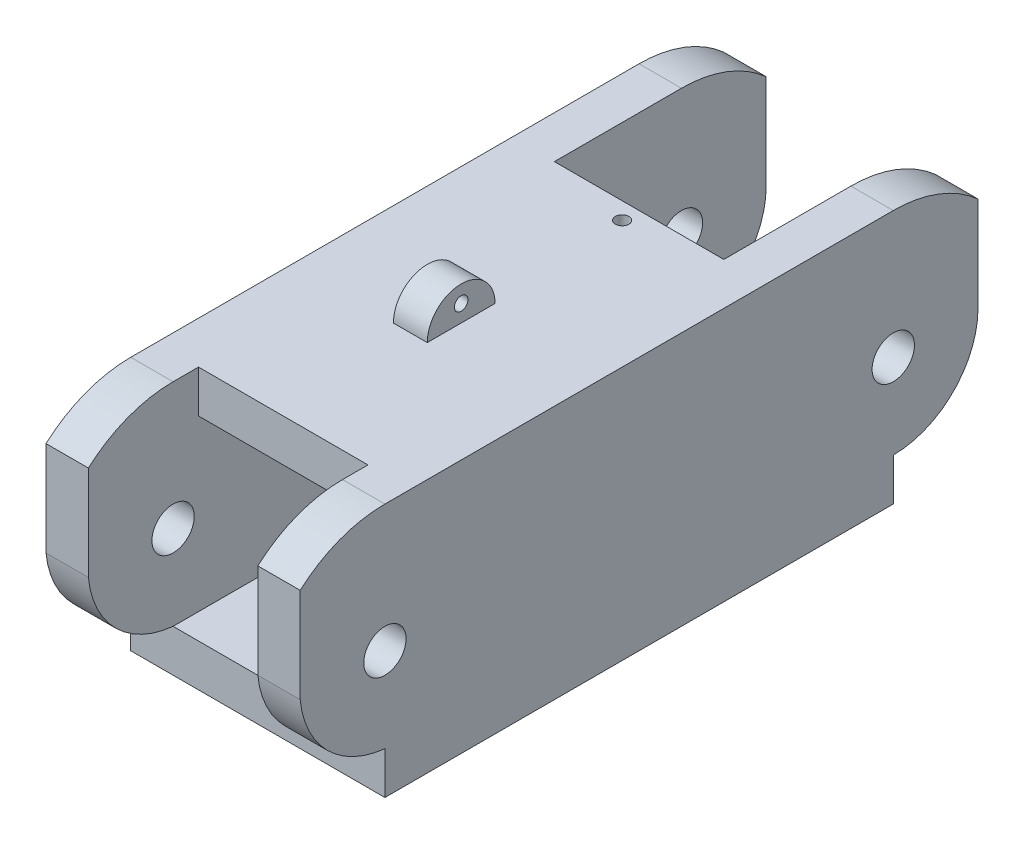
ISO-10303-21;
HEADER;
FILE_DESCRIPTION(('STEP AP214'),'2;1');
FILE_NAME('part.step','',(''),(''),'','','');
FILE_SCHEMA(('AUTOMOTIVE_DESIGN { 1 0 10303 214 1 1 1 1 }'));
ENDSEC;
DATA;
#1=APPLICATION_CONTEXT('core data for automotive mechanical design processes');
#2=APPLICATION_PROTOCOL_DEFINITION('international standard','automotive_design',2000,#1);
#3=PRODUCT_CONTEXT('',#1,'mechanical');
#4=PRODUCT('Part','Part','',(#3));
#5=PRODUCT_RELATED_PRODUCT_CATEGORY('part','',(#4));
#6=PRODUCT_DEFINITION_FORMATION('','',#4);
#7=PRODUCT_DEFINITION_CONTEXT('part definition',#1,'design');
#8=PRODUCT_DEFINITION('design','',#6,#7);
#9=PRODUCT_DEFINITION_SHAPE('','',#8);
#10=(LENGTH_UNIT() NAMED_UNIT(*) SI_UNIT(.MILLI.,.METRE.));
#11=(NAMED_UNIT(*) PLANE_ANGLE_UNIT() SI_UNIT($,.RADIAN.));
#12=(NAMED_UNIT(*) SI_UNIT($,.STERADIAN.) SOLID_ANGLE_UNIT());
#13=UNCERTAINTY_MEASURE_WITH_UNIT(LENGTH_MEASURE(1.E-05),#10,'distance_accuracy_value','');
#14=(GEOMETRIC_REPRESENTATION_CONTEXT(3) GLOBAL_UNCERTAINTY_ASSIGNED_CONTEXT((#13)) GLOBAL_UNIT_ASSIGNED_CONTEXT((#10,
#11,#12)) REPRESENTATION_CONTEXT('',''));
#15=CARTESIAN_POINT('',(0.,0.,0.));
#16=DIRECTION('',(0.,0.,1.));
#17=DIRECTION('',(1.,0.,0.));
#18=AXIS2_PLACEMENT_3D('',#15,#16,#17);
#19=CARTESIAN_POINT('',(19.05,9.525,-47.625));
#20=DIRECTION('',(-1.,0.,0.));
#21=DIRECTION('',(0.,0.,1.));
#22=AXIS2_PLACEMENT_3D('',#19,#20,#21);
#23=CYLINDRICAL_SURFACE('',#22,9.525);
#24=CARTESIAN_POINT('',(3.175,9.525,-47.625));
#25=DIRECTION('',(-1.,0.,0.));
#26=DIRECTION('',(0.,-1.,0.));
#27=AXIS2_PLACEMENT_3D('',#24,#25,#26);
#28=CIRCLE('',#27,9.525);
#29=CARTESIAN_POINT('',(3.175,19.05,-47.625));
#30=VERTEX_POINT('',#29);
#31=CARTESIAN_POINT('',(3.175,16.6245158285618,-53.975));
#32=VERTEX_POINT('',#31);
#33=EDGE_CURVE('E425',#30,#32,#28,.T.);
#34=ORIENTED_EDGE('',*,*,#33,.T.);
#35=DIRECTION('',(-1.,0.,0.));
#36=VECTOR('',#35,1.);
#37=CARTESIAN_POINT('',(19.05,16.6245158285618,-53.975));
#38=LINE('',#37,#36);
#39=CARTESIAN_POINT('',(0.,16.6245158285618,-53.975));
#40=VERTEX_POINT('',#39);
#41=EDGE_CURVE('E478',#32,#40,#38,.T.);
#42=ORIENTED_EDGE('',*,*,#41,.T.);
#43=CARTESIAN_POINT('',(0.,9.525,-47.625));
#44=DIRECTION('',(-1.,0.,0.));
#45=DIRECTION('',(0.,0.,-1.));
#46=AXIS2_PLACEMENT_3D('',#43,#44,#45);
#47=CIRCLE('',#46,9.525);
#48=CARTESIAN_POINT('',(0.,19.05,-47.625));
#49=VERTEX_POINT('',#48);
#50=EDGE_CURVE('E447',#49,#40,#47,.T.);
#51=ORIENTED_EDGE('',*,*,#50,.F.);
#52=DIRECTION('',(-1.,0.,0.));
#53=VECTOR('',#52,1.);
#54=CARTESIAN_POINT('',(19.05,19.05,-47.625));
#55=LINE('',#54,#53);
#56=EDGE_CURVE('E443',#30,#49,#55,.T.);
#57=ORIENTED_EDGE('',*,*,#56,.F.);
#58=EDGE_LOOP('',(#34,#42,#51,#57));
#59=FACE_BOUND('',#58,.T.);
#60=ADVANCED_FACE('F39',(#59),#23,.T.);
#61=CARTESIAN_POINT('',(19.05,9.525,-47.625));
#62=DIRECTION('',(-1.,0.,0.));
#63=DIRECTION('',(0.,0.,-1.));
#64=AXIS2_PLACEMENT_3D('',#61,#62,#63);
#65=CIRCLE('',#64,9.525);
#66=CARTESIAN_POINT('',(19.05,19.05,-47.625));
#67=VERTEX_POINT('',#66);
#68=CARTESIAN_POINT('',(19.05,16.6245158285618,-53.975));
#69=VERTEX_POINT('',#68);
#70=EDGE_CURVE('E446',#67,#69,#65,.T.);
#71=ORIENTED_EDGE('',*,*,#70,.T.);
#72=DIRECTION('',(-1.,0.,0.));
#73=VECTOR('',#72,1.);
#74=CARTESIAN_POINT('',(19.05,16.6245158285618,-53.975));
#75=LINE('',#74,#73);
#76=CARTESIAN_POINT('',(15.875,16.6245158285618,-53.975));
#77=VERTEX_POINT('',#76);
#78=EDGE_CURVE('E484',#69,#77,#75,.T.);
#79=ORIENTED_EDGE('',*,*,#78,.T.);
#80=CARTESIAN_POINT('',(15.875,9.525,-47.625));
#81=DIRECTION('',(1.,0.,0.));
#82=DIRECTION('',(0.,1.,0.));
#83=AXIS2_PLACEMENT_3D('',#80,#81,#82);
#84=CIRCLE('',#83,9.525);
#85=CARTESIAN_POINT('',(15.875,19.05,-47.625));
#86=VERTEX_POINT('',#85);
#87=EDGE_CURVE('E267',#77,#86,#84,.T.);
#88=ORIENTED_EDGE('',*,*,#87,.T.);
#89=EDGE_CURVE('E343',#67,#86,#55,.T.);
#90=ORIENTED_EDGE('',*,*,#89,.F.);
#91=EDGE_LOOP('',(#71,#79,#88,#90));
#92=FACE_BOUND('',#91,.T.);
#93=ADVANCED_FACE('F592',(#92),#23,.T.);
#94=CARTESIAN_POINT('',(19.05,9.525,-9.525));
#95=DIRECTION('',(-1.,0.,0.));
#96=DIRECTION('',(0.,0.,1.));
#97=AXIS2_PLACEMENT_3D('',#94,#95,#96);
#98=CYLINDRICAL_SURFACE('',#97,9.525);
#99=CARTESIAN_POINT('',(0.,9.525,-9.525));
#100=DIRECTION('',(-1.,0.,0.));
#101=DIRECTION('',(0.,0.,-1.));
#102=AXIS2_PLACEMENT_3D('',#99,#100,#101);
#103=CIRCLE('',#102,9.525);
#104=CARTESIAN_POINT('',(0.,16.6245158285618,-3.175));
#105=VERTEX_POINT('',#104);
#106=CARTESIAN_POINT('',(0.,19.05,-9.525));
#107=VERTEX_POINT('',#106);
#108=EDGE_CURVE('E284',#105,#107,#103,.T.);
#109=ORIENTED_EDGE('',*,*,#108,.F.);
#110=DIRECTION('',(-1.,0.,0.));
#111=VECTOR('',#110,1.);
#112=CARTESIAN_POINT('',(19.05,16.6245158285618,-3.17500000000001));
#113=LINE('',#112,#111);
#114=CARTESIAN_POINT('',(3.175,16.6245158285618,-3.17500000000001));
#115=VERTEX_POINT('',#114);
#116=EDGE_CURVE('E488',#105,#115,#113,.F.);
#117=ORIENTED_EDGE('',*,*,#116,.T.);
#118=CARTESIAN_POINT('',(3.175,9.525,-9.525));
#119=DIRECTION('',(-1.,0.,0.));
#120=DIRECTION('',(0.,-1.,0.));
#121=AXIS2_PLACEMENT_3D('',#118,#119,#120);
#122=CIRCLE('',#121,9.525);
#123=CARTESIAN_POINT('',(3.17500000000001,19.05,-9.525));
#124=VERTEX_POINT('',#123);
#125=EDGE_CURVE('E254',#115,#124,#122,.T.);
#126=ORIENTED_EDGE('',*,*,#125,.T.);
#127=DIRECTION('',(-1.,0.,0.));
#128=VECTOR('',#127,1.);
#129=CARTESIAN_POINT('',(19.05,19.05,-9.525));
#130=LINE('',#129,#128);
#131=EDGE_CURVE('E283',#124,#107,#130,.T.);
#132=ORIENTED_EDGE('',*,*,#131,.T.);
#133=EDGE_LOOP('',(#109,#117,#126,#132));
#134=FACE_BOUND('',#133,.T.);
#135=ADVANCED_FACE('F580',(#134),#98,.T.);
#136=CARTESIAN_POINT('',(0.,19.05,0.));
#137=DIRECTION('',(1.,0.,0.));
#138=DIRECTION('',(0.,0.,-1.));
#139=AXIS2_PLACEMENT_3D('',#136,#137,#138);
#140=PLANE('',#139);
#141=CARTESIAN_POINT('',(0.,9.525,-47.625));
#142=DIRECTION('',(1.,0.,0.));
#143=DIRECTION('',(0.,0.,-1.));
#144=AXIS2_PLACEMENT_3D('',#141,#142,#143);
#145=CIRCLE('',#144,1.5875);
#146=CARTESIAN_POINT('',(0.,9.525,-49.2125));
#147=VERTEX_POINT('',#146);
#148=EDGE_CURVE('E434',#147,#147,#145,.T.);
#149=ORIENTED_EDGE('',*,*,#148,.T.);
#150=EDGE_LOOP('',(#149));
#151=FACE_BOUND('',#150,.T.);
#152=CARTESIAN_POINT('',(0.,9.525,-9.525));
#153=DIRECTION('',(1.,0.,0.));
#154=DIRECTION('',(0.,0.,-1.));
#155=AXIS2_PLACEMENT_3D('',#152,#153,#154);
#156=CIRCLE('',#155,1.5875);
#157=CARTESIAN_POINT('',(0.,9.525,-11.1125));
#158=VERTEX_POINT('',#157);
#159=EDGE_CURVE('E259',#158,#158,#156,.T.);
#160=ORIENTED_EDGE('',*,*,#159,.T.);
#161=EDGE_LOOP('',(#160));
#162=FACE_BOUND('',#161,.T.);
#163=DIRECTION('',(0.,1.,0.));
#164=VECTOR('',#163,1.);
#165=CARTESIAN_POINT('',(0.,0.,-9.525));
#166=LINE('',#165,#164);
#167=CARTESIAN_POINT('',(0.,0.,-9.525));
#168=VERTEX_POINT('',#167);
#169=CARTESIAN_POINT('',(0.,3.175,-9.525));
#170=VERTEX_POINT('',#169);
#171=EDGE_CURVE('E208',#168,#170,#166,.T.);
#172=ORIENTED_EDGE('',*,*,#171,.T.);
#173=CARTESIAN_POINT('',(0.,10.2236491395655,-10.2236491395655));
#174=DIRECTION('',(-1.,0.,0.));
#175=DIRECTION('',(0.,0.,-1.));
#176=AXIS2_PLACEMENT_3D('',#173,#174,#175);
#177=CIRCLE('',#176,7.08318892257665);
#178=CARTESIAN_POINT('',(0.,9.525,-3.175));
#179=VERTEX_POINT('',#178);
#180=EDGE_CURVE('E544',#170,#179,#177,.T.);
#181=ORIENTED_EDGE('',*,*,#180,.T.);
#182=DIRECTION('',(0.,1.,0.));
#183=VECTOR('',#182,1.);
#184=CARTESIAN_POINT('',(0.,9.525,-3.175));
#185=LINE('',#184,#183);
#186=EDGE_CURVE('E225',#179,#105,#185,.T.);
#187=ORIENTED_EDGE('',*,*,#186,.T.);
#188=ORIENTED_EDGE('',*,*,#108,.T.);
#189=DIRECTION('',(0.,0.,1.));
#190=VECTOR('',#189,1.);
#191=CARTESIAN_POINT('',(0.,19.05,0.));
#192=LINE('',#191,#190);
#193=EDGE_CURVE('E231',#49,#107,#192,.T.);
#194=ORIENTED_EDGE('',*,*,#193,.F.);
#195=ORIENTED_EDGE('',*,*,#50,.T.);
#196=DIRECTION('',(0.,-1.,0.));
#197=VECTOR('',#196,1.);
#198=CARTESIAN_POINT('',(0.,9.52500000000001,-53.975));
#199=LINE('',#198,#197);
#200=CARTESIAN_POINT('',(0.,9.525,-53.975));
#201=VERTEX_POINT('',#200);
#202=EDGE_CURVE('E523',#40,#201,#199,.T.);
#203=ORIENTED_EDGE('',*,*,#202,.T.);
#204=CARTESIAN_POINT('',(0.,9.525,-47.625));
#205=DIRECTION('',(-1.,0.,0.));
#206=DIRECTION('',(0.,0.,-1.));
#207=AXIS2_PLACEMENT_3D('',#204,#205,#206);
#208=CIRCLE('',#207,6.35);
#209=CARTESIAN_POINT('',(0.,3.175,-47.6250000000001));
#210=VERTEX_POINT('',#209);
#211=EDGE_CURVE('E519',#201,#210,#208,.T.);
#212=ORIENTED_EDGE('',*,*,#211,.T.);
#213=DIRECTION('',(0.,-1.,0.));
#214=VECTOR('',#213,1.);
#215=CARTESIAN_POINT('',(0.,0.,-47.6250000000001));
#216=LINE('',#215,#214);
#217=CARTESIAN_POINT('',(0.,0.,-47.6250000000001));
#218=VERTEX_POINT('',#217);
#219=EDGE_CURVE('E514',#210,#218,#216,.T.);
#220=ORIENTED_EDGE('',*,*,#219,.T.);
#221=DIRECTION('',(0.,0.,1.));
#222=VECTOR('',#221,1.);
#223=CARTESIAN_POINT('',(0.,0.,0.));
#224=LINE('',#223,#222);
#225=EDGE_CURVE('E232',#218,#168,#224,.T.);
#226=ORIENTED_EDGE('',*,*,#225,.T.);
#227=EDGE_LOOP('',(#172,#181,#187,#188,#194,#195,#203,#212,#220,#226));
#228=FACE_BOUND('',#227,.T.);
#229=ADVANCED_FACE('F41',(#151,#162,#228),#140,.F.);
#230=CARTESIAN_POINT('',(19.05,19.05,0.));
#231=DIRECTION('',(-1.,0.,0.));
#232=DIRECTION('',(0.,0.,1.));
#233=AXIS2_PLACEMENT_3D('',#230,#231,#232);
#234=PLANE('',#233);
#235=CARTESIAN_POINT('',(19.05,9.525,-47.625));
#236=DIRECTION('',(1.,0.,0.));
#237=DIRECTION('',(0.,0.,-1.));
#238=AXIS2_PLACEMENT_3D('',#235,#236,#237);
#239=CIRCLE('',#238,1.5875);
#240=CARTESIAN_POINT('',(19.05,9.525,-49.2125));
#241=VERTEX_POINT('',#240);
#242=EDGE_CURVE('E266',#241,#241,#239,.T.);
#243=ORIENTED_EDGE('',*,*,#242,.F.);
#244=EDGE_LOOP('',(#243));
#245=FACE_BOUND('',#244,.T.);
#246=CARTESIAN_POINT('',(19.05,9.525,-9.525));
#247=DIRECTION('',(1.,0.,0.));
#248=DIRECTION('',(0.,0.,-1.));
#249=AXIS2_PLACEMENT_3D('',#246,#247,#248);
#250=CIRCLE('',#249,1.5875);
#251=CARTESIAN_POINT('',(19.05,9.525,-11.1125));
#252=VERTEX_POINT('',#251);
#253=EDGE_CURVE('E290',#252,#252,#250,.T.);
#254=ORIENTED_EDGE('',*,*,#253,.F.);
#255=EDGE_LOOP('',(#254));
#256=FACE_BOUND('',#255,.T.);
#257=DIRECTION('',(0.,1.,0.));
#258=VECTOR('',#257,1.);
#259=CARTESIAN_POINT('',(19.05,0.,-9.525));
#260=LINE('',#259,#258);
#261=CARTESIAN_POINT('',(19.05,0.,-9.525));
#262=VERTEX_POINT('',#261);
#263=CARTESIAN_POINT('',(19.05,3.175,-9.525));
#264=VERTEX_POINT('',#263);
#265=EDGE_CURVE('E205',#262,#264,#260,.T.);
#266=ORIENTED_EDGE('',*,*,#265,.F.);
#267=DIRECTION('',(0.,0.,-1.));
#268=VECTOR('',#267,1.);
#269=CARTESIAN_POINT('',(19.05,0.,0.));
#270=LINE('',#269,#268);
#271=CARTESIAN_POINT('',(19.05,0.,-47.6250000000001));
#272=VERTEX_POINT('',#271);
#273=EDGE_CURVE('E222',#262,#272,#270,.T.);
#274=ORIENTED_EDGE('',*,*,#273,.T.);
#275=DIRECTION('',(0.,-1.,0.));
#276=VECTOR('',#275,1.);
#277=CARTESIAN_POINT('',(19.05,0.,-47.6250000000001));
#278=LINE('',#277,#276);
#279=CARTESIAN_POINT('',(19.05,3.175,-47.6250000000001));
#280=VERTEX_POINT('',#279);
#281=EDGE_CURVE('E527',#280,#272,#278,.T.);
#282=ORIENTED_EDGE('',*,*,#281,.F.);
#283=CARTESIAN_POINT('',(19.05,9.525,-47.625));
#284=DIRECTION('',(-1.,0.,0.));
#285=DIRECTION('',(0.,0.,-1.));
#286=AXIS2_PLACEMENT_3D('',#283,#284,#285);
#287=CIRCLE('',#286,6.35);
#288=CARTESIAN_POINT('',(19.05,9.525,-53.975));
#289=VERTEX_POINT('',#288);
#290=EDGE_CURVE('E530',#289,#280,#287,.T.);
#291=ORIENTED_EDGE('',*,*,#290,.F.);
#292=DIRECTION('',(0.,-1.,0.));
#293=VECTOR('',#292,1.);
#294=CARTESIAN_POINT('',(19.05,9.52500000000001,-53.975));
#295=LINE('',#294,#293);
#296=EDGE_CURVE('E518',#69,#289,#295,.T.);
#297=ORIENTED_EDGE('',*,*,#296,.F.);
#298=ORIENTED_EDGE('',*,*,#70,.F.);
#299=DIRECTION('',(0.,0.,-1.));
#300=VECTOR('',#299,1.);
#301=CARTESIAN_POINT('',(19.05,19.05,0.));
#302=LINE('',#301,#300);
#303=CARTESIAN_POINT('',(19.05,19.05,-9.525));
#304=VERTEX_POINT('',#303);
#305=EDGE_CURVE('E237',#304,#67,#302,.T.);
#306=ORIENTED_EDGE('',*,*,#305,.F.);
#307=CARTESIAN_POINT('',(19.05,9.525,-9.525));
#308=DIRECTION('',(-1.,0.,0.));
#309=DIRECTION('',(0.,0.,-1.));
#310=AXIS2_PLACEMENT_3D('',#307,#308,#309);
#311=CIRCLE('',#310,9.525);
#312=CARTESIAN_POINT('',(19.05,16.6245158285618,-3.175));
#313=VERTEX_POINT('',#312);
#314=EDGE_CURVE('E275',#313,#304,#311,.T.);
#315=ORIENTED_EDGE('',*,*,#314,.F.);
#316=DIRECTION('',(0.,1.,0.));
#317=VECTOR('',#316,1.);
#318=CARTESIAN_POINT('',(19.05,9.525,-3.175));
#319=LINE('',#318,#317);
#320=CARTESIAN_POINT('',(19.05,9.525,-3.175));
#321=VERTEX_POINT('',#320);
#322=EDGE_CURVE('E63',#321,#313,#319,.T.);
#323=ORIENTED_EDGE('',*,*,#322,.F.);
#324=CARTESIAN_POINT('',(19.05,10.2236491395655,-10.2236491395655));
#325=DIRECTION('',(-1.,0.,0.));
#326=DIRECTION('',(0.,0.,-1.));
#327=AXIS2_PLACEMENT_3D('',#324,#325,#326);
#328=CIRCLE('',#327,7.08318892257665);
#329=EDGE_CURVE('E223',#264,#321,#328,.T.);
#330=ORIENTED_EDGE('',*,*,#329,.F.);
#331=EDGE_LOOP('',(#266,#274,#282,#291,#297,#298,#306,#315,#323,#330));
#332=FACE_BOUND('',#331,.T.);
#333=ADVANCED_FACE('F220',(#245,#256,#332),#234,.F.);
#334=CARTESIAN_POINT('',(3.175,15.875,-76.2));
#335=DIRECTION('',(-1.,0.,0.));
#336=DIRECTION('',(0.,-1.,0.));
#337=AXIS2_PLACEMENT_3D('',#334,#335,#336);
#338=PLANE('',#337);
#339=CARTESIAN_POINT('',(3.175,9.525,-9.525));
#340=DIRECTION('',(-1.,0.,0.));
#341=DIRECTION('',(0.,-1.,0.));
#342=AXIS2_PLACEMENT_3D('',#339,#340,#341);
#343=CIRCLE('',#342,1.5875);
#344=CARTESIAN_POINT('',(3.175,7.9375,-9.525));
#345=VERTEX_POINT('',#344);
#346=EDGE_CURVE('E253',#345,#345,#343,.F.);
#347=ORIENTED_EDGE('',*,*,#346,.F.);
#348=EDGE_LOOP('',(#347));
#349=FACE_BOUND('',#348,.T.);
#350=CARTESIAN_POINT('',(3.175,9.525,-47.625));
#351=DIRECTION('',(-1.,0.,0.));
#352=DIRECTION('',(0.,-1.,0.));
#353=AXIS2_PLACEMENT_3D('',#350,#351,#352);
#354=CIRCLE('',#353,1.5875);
#355=CARTESIAN_POINT('',(3.175,7.9375,-47.625));
#356=VERTEX_POINT('',#355);
#357=EDGE_CURVE('E265',#356,#356,#354,.F.);
#358=ORIENTED_EDGE('',*,*,#357,.F.);
#359=EDGE_LOOP('',(#358));
#360=FACE_BOUND('',#359,.T.);
#361=CARTESIAN_POINT('',(3.175,10.2236491395655,-10.2236491395655));
#362=DIRECTION('',(-1.,0.,0.));
#363=DIRECTION('',(0.,-1.,0.));
#364=AXIS2_PLACEMENT_3D('',#361,#362,#363);
#365=CIRCLE('',#364,7.08318892257665);
#366=CARTESIAN_POINT('',(3.17500000000001,3.175,-9.525));
#367=VERTEX_POINT('',#366);
#368=CARTESIAN_POINT('',(3.175,9.525,-3.17500000000001));
#369=VERTEX_POINT('',#368);
#370=EDGE_CURVE('E405',#367,#369,#365,.T.);
#371=ORIENTED_EDGE('',*,*,#370,.F.);
#372=DIRECTION('',(0.,0.,1.));
#373=VECTOR('',#372,1.);
#374=CARTESIAN_POINT('',(3.175,3.175,-76.2));
#375=LINE('',#374,#373);
#376=CARTESIAN_POINT('',(3.175,3.175,-47.625));
#377=VERTEX_POINT('',#376);
#378=EDGE_CURVE('E325',#377,#367,#375,.T.);
#379=ORIENTED_EDGE('',*,*,#378,.F.);
#380=CARTESIAN_POINT('',(3.175,9.525,-47.625));
#381=DIRECTION('',(-1.,0.,0.));
#382=DIRECTION('',(0.,-1.,0.));
#383=AXIS2_PLACEMENT_3D('',#380,#381,#382);
#384=CIRCLE('',#383,6.35);
#385=CARTESIAN_POINT('',(3.17500000000001,9.525,-53.975));
#386=VERTEX_POINT('',#385);
#387=EDGE_CURVE('E498',#386,#377,#384,.T.);
#388=ORIENTED_EDGE('',*,*,#387,.F.);
#389=DIRECTION('',(0.,-1.,0.));
#390=VECTOR('',#389,1.);
#391=CARTESIAN_POINT('',(3.175,15.875,-53.975));
#392=LINE('',#391,#390);
#393=EDGE_CURVE('E481',#32,#386,#392,.T.);
#394=ORIENTED_EDGE('',*,*,#393,.F.);
#395=ORIENTED_EDGE('',*,*,#33,.F.);
#396=DIRECTION('',(0.,0.,1.));
#397=VECTOR('',#396,1.);
#398=CARTESIAN_POINT('',(3.175,19.05,-69.0709609780491));
#399=LINE('',#398,#397);
#400=CARTESIAN_POINT('',(3.175,19.05,-38.1));
#401=VERTEX_POINT('',#400);
#402=EDGE_CURVE('E472',#30,#401,#399,.T.);
#403=ORIENTED_EDGE('',*,*,#402,.T.);
#404=DIRECTION('',(0.,1.,0.));
#405=VECTOR('',#404,1.);
#406=CARTESIAN_POINT('',(3.175,15.24,-38.1));
#407=LINE('',#406,#405);
#408=CARTESIAN_POINT('',(3.175,15.875,-38.1));
#409=VERTEX_POINT('',#408);
#410=EDGE_CURVE('E459',#409,#401,#407,.T.);
#411=ORIENTED_EDGE('',*,*,#410,.F.);
#412=DIRECTION('',(0.,0.,1.));
#413=VECTOR('',#412,1.);
#414=CARTESIAN_POINT('',(3.175,15.875,-76.2));
#415=LINE('',#414,#413);
#416=CARTESIAN_POINT('',(3.17500000000001,15.875,-11.43));
#417=VERTEX_POINT('',#416);
#418=EDGE_CURVE('E239',#409,#417,#415,.T.);
#419=ORIENTED_EDGE('',*,*,#418,.T.);
#420=DIRECTION('',(0.,1.,0.));
#421=VECTOR('',#420,1.);
#422=CARTESIAN_POINT('',(3.17500000000001,6.35,-11.43));
#423=LINE('',#422,#421);
#424=CARTESIAN_POINT('',(3.17500000000001,19.05,-11.43));
#425=VERTEX_POINT('',#424);
#426=EDGE_CURVE('E370',#417,#425,#423,.T.);
#427=ORIENTED_EDGE('',*,*,#426,.T.);
#428=DIRECTION('',(0.,0.,1.));
#429=VECTOR('',#428,1.);
#430=CARTESIAN_POINT('',(3.17500000000001,19.05,0.));
#431=LINE('',#430,#429);
#432=EDGE_CURVE('E358',#425,#124,#431,.T.);
#433=ORIENTED_EDGE('',*,*,#432,.T.);
#434=ORIENTED_EDGE('',*,*,#125,.F.);
#435=DIRECTION('',(0.,1.,0.));
#436=VECTOR('',#435,1.);
#437=CARTESIAN_POINT('',(3.175,15.875,-3.17500000000001));
#438=LINE('',#437,#436);
#439=EDGE_CURVE('E408',#369,#115,#438,.T.);
#440=ORIENTED_EDGE('',*,*,#439,.F.);
#441=EDGE_LOOP('',(#371,#379,#388,#394,#395,#403,#411,#419,#427,#433,#434,#440));
#442=FACE_BOUND('',#441,.T.);
#443=ADVANCED_FACE('F394',(#349,#360,#442),#338,.F.);
#444=CARTESIAN_POINT('',(15.875,15.875,-76.2));
#445=DIRECTION('',(1.,0.,0.));
#446=DIRECTION('',(0.,1.,0.));
#447=AXIS2_PLACEMENT_3D('',#444,#445,#446);
#448=PLANE('',#447);
#449=CARTESIAN_POINT('',(15.875,9.525,-9.525));
#450=DIRECTION('',(1.,0.,0.));
#451=DIRECTION('',(0.,1.,0.));
#452=AXIS2_PLACEMENT_3D('',#449,#450,#451);
#453=CIRCLE('',#452,1.5875);
#454=CARTESIAN_POINT('',(15.875,11.1125,-9.525));
#455=VERTEX_POINT('',#454);
#456=EDGE_CURVE('E249',#455,#455,#453,.F.);
#457=ORIENTED_EDGE('',*,*,#456,.F.);
#458=EDGE_LOOP('',(#457));
#459=FACE_BOUND('',#458,.T.);
#460=CARTESIAN_POINT('',(15.875,9.525,-47.625));
#461=DIRECTION('',(1.,0.,0.));
#462=DIRECTION('',(0.,1.,0.));
#463=AXIS2_PLACEMENT_3D('',#460,#461,#462);
#464=CIRCLE('',#463,1.5875);
#465=CARTESIAN_POINT('',(15.875,11.1125,-47.625));
#466=VERTEX_POINT('',#465);
#467=EDGE_CURVE('E261',#466,#466,#464,.F.);
#468=ORIENTED_EDGE('',*,*,#467,.F.);
#469=EDGE_LOOP('',(#468));
#470=FACE_BOUND('',#469,.T.);
#471=CARTESIAN_POINT('',(15.875,10.2236491395655,-10.2236491395655));
#472=DIRECTION('',(1.,0.,0.));
#473=DIRECTION('',(0.,1.,0.));
#474=AXIS2_PLACEMENT_3D('',#471,#472,#473);
#475=CIRCLE('',#474,7.08318892257665);
#476=CARTESIAN_POINT('',(15.875,9.525,-3.175));
#477=VERTEX_POINT('',#476);
#478=CARTESIAN_POINT('',(15.875,3.175,-9.525));
#479=VERTEX_POINT('',#478);
#480=EDGE_CURVE('E412',#477,#479,#475,.T.);
#481=ORIENTED_EDGE('',*,*,#480,.F.);
#482=DIRECTION('',(0.,-1.,0.));
#483=VECTOR('',#482,1.);
#484=CARTESIAN_POINT('',(15.875,15.875,-3.17500000000001));
#485=LINE('',#484,#483);
#486=CARTESIAN_POINT('',(15.875,16.6245158285618,-3.17500000000001));
#487=VERTEX_POINT('',#486);
#488=EDGE_CURVE('E411',#487,#477,#485,.T.);
#489=ORIENTED_EDGE('',*,*,#488,.F.);
#490=CARTESIAN_POINT('',(15.875,9.525,-9.525));
#491=DIRECTION('',(1.,0.,0.));
#492=DIRECTION('',(0.,1.,0.));
#493=AXIS2_PLACEMENT_3D('',#490,#491,#492);
#494=CIRCLE('',#493,9.525);
#495=CARTESIAN_POINT('',(15.875,19.05,-9.525));
#496=VERTEX_POINT('',#495);
#497=EDGE_CURVE('E277',#496,#487,#494,.T.);
#498=ORIENTED_EDGE('',*,*,#497,.F.);
#499=DIRECTION('',(0.,0.,-1.));
#500=VECTOR('',#499,1.);
#501=CARTESIAN_POINT('',(15.875,19.05,0.));
#502=LINE('',#501,#500);
#503=CARTESIAN_POINT('',(15.875,19.05,-11.43));
#504=VERTEX_POINT('',#503);
#505=EDGE_CURVE('E347',#496,#504,#502,.T.);
#506=ORIENTED_EDGE('',*,*,#505,.T.);
#507=DIRECTION('',(0.,1.,0.));
#508=VECTOR('',#507,1.);
#509=CARTESIAN_POINT('',(15.875,6.35,-11.43));
#510=LINE('',#509,#508);
#511=CARTESIAN_POINT('',(15.875,15.875,-11.43));
#512=VERTEX_POINT('',#511);
#513=EDGE_CURVE('E369',#512,#504,#510,.T.);
#514=ORIENTED_EDGE('',*,*,#513,.F.);
#515=DIRECTION('',(0.,0.,1.));
#516=VECTOR('',#515,1.);
#517=CARTESIAN_POINT('',(15.875,15.875,-76.2));
#518=LINE('',#517,#516);
#519=CARTESIAN_POINT('',(15.875,15.875,-38.1));
#520=VERTEX_POINT('',#519);
#521=EDGE_CURVE('E328',#520,#512,#518,.T.);
#522=ORIENTED_EDGE('',*,*,#521,.F.);
#523=DIRECTION('',(0.,1.,0.));
#524=VECTOR('',#523,1.);
#525=CARTESIAN_POINT('',(15.875,15.24,-38.1));
#526=LINE('',#525,#524);
#527=CARTESIAN_POINT('',(15.875,19.05,-38.1));
#528=VERTEX_POINT('',#527);
#529=EDGE_CURVE('E458',#520,#528,#526,.T.);
#530=ORIENTED_EDGE('',*,*,#529,.T.);
#531=DIRECTION('',(0.,0.,-1.));
#532=VECTOR('',#531,1.);
#533=CARTESIAN_POINT('',(15.875,19.05,-69.0709609780491));
#534=LINE('',#533,#532);
#535=EDGE_CURVE('E462',#528,#86,#534,.T.);
#536=ORIENTED_EDGE('',*,*,#535,.T.);
#537=ORIENTED_EDGE('',*,*,#87,.F.);
#538=DIRECTION('',(0.,1.,0.));
#539=VECTOR('',#538,1.);
#540=CARTESIAN_POINT('',(15.875,15.875,-53.975));
#541=LINE('',#540,#539);
#542=CARTESIAN_POINT('',(15.875,9.525,-53.975));
#543=VERTEX_POINT('',#542);
#544=EDGE_CURVE('E11',#543,#77,#541,.T.);
#545=ORIENTED_EDGE('',*,*,#544,.F.);
#546=CARTESIAN_POINT('',(15.875,9.525,-47.625));
#547=DIRECTION('',(1.,0.,0.));
#548=DIRECTION('',(0.,1.,0.));
#549=AXIS2_PLACEMENT_3D('',#546,#547,#548);
#550=CIRCLE('',#549,6.35);
#551=CARTESIAN_POINT('',(15.875,3.175,-47.6250000000001));
#552=VERTEX_POINT('',#551);
#553=EDGE_CURVE('E502',#552,#543,#550,.T.);
#554=ORIENTED_EDGE('',*,*,#553,.F.);
#555=DIRECTION('',(0.,0.,1.));
#556=VECTOR('',#555,1.);
#557=CARTESIAN_POINT('',(15.875,3.175,-76.2));
#558=LINE('',#557,#556);
#559=EDGE_CURVE('E331',#552,#479,#558,.T.);
#560=ORIENTED_EDGE('',*,*,#559,.T.);
#561=EDGE_LOOP('',(#481,#489,#498,#506,#514,#522,#530,#536,#537,#545,#554,#560));
#562=FACE_BOUND('',#561,.T.);
#563=ADVANCED_FACE('F397',(#459,#470,#562),#448,.F.);
#564=ORIENTED_EDGE('',*,*,#497,.T.);
#565=DIRECTION('',(-1.,0.,0.));
#566=VECTOR('',#565,1.);
#567=CARTESIAN_POINT('',(19.05,16.6245158285618,-3.17500000000001));
#568=LINE('',#567,#566);
#569=EDGE_CURVE('E48',#487,#313,#568,.F.);
#570=ORIENTED_EDGE('',*,*,#569,.T.);
#571=ORIENTED_EDGE('',*,*,#314,.T.);
#572=EDGE_CURVE('E215',#304,#496,#130,.T.);
#573=ORIENTED_EDGE('',*,*,#572,.T.);
#574=EDGE_LOOP('',(#564,#570,#571,#573));
#575=FACE_BOUND('',#574,.T.);
#576=ADVANCED_FACE('F273',(#575),#98,.T.);
#577=CARTESIAN_POINT('',(3.175,3.175,-76.2));
#578=DIRECTION('',(0.,-1.,0.));
#579=DIRECTION('',(0.,0.,-1.));
#580=AXIS2_PLACEMENT_3D('',#577,#578,#579);
#581=PLANE('',#580);
#582=DIRECTION('',(1.,0.,0.));
#583=VECTOR('',#582,1.);
#584=CARTESIAN_POINT('',(3.175,3.175,-47.625));
#585=LINE('',#584,#583);
#586=EDGE_CURVE('E420',#377,#552,#585,.T.);
#587=ORIENTED_EDGE('',*,*,#586,.F.);
#588=ORIENTED_EDGE('',*,*,#378,.T.);
#589=DIRECTION('',(1.,0.,0.));
#590=VECTOR('',#589,1.);
#591=CARTESIAN_POINT('',(3.175,3.175,-9.52500000000001));
#592=LINE('',#591,#590);
#593=EDGE_CURVE('E361',#367,#479,#592,.T.);
#594=ORIENTED_EDGE('',*,*,#593,.T.);
#595=ORIENTED_EDGE('',*,*,#559,.F.);
#596=EDGE_LOOP('',(#587,#588,#594,#595));
#597=FACE_BOUND('',#596,.T.);
#598=ADVANCED_FACE('F417',(#597),#581,.F.);
#599=CARTESIAN_POINT('',(3.175,15.875,-76.2));
#600=DIRECTION('',(0.,1.,0.));
#601=DIRECTION('',(0.,0.,1.));
#602=AXIS2_PLACEMENT_3D('',#599,#600,#601);
#603=PLANE('',#602);
#604=CARTESIAN_POINT('',(9.525,15.875,-36.83));
#605=DIRECTION('',(0.,1.,0.));
#606=DIRECTION('',(0.,0.,1.));
#607=AXIS2_PLACEMENT_3D('',#604,#605,#606);
#608=CIRCLE('',#607,0.507999999999999);
#609=CARTESIAN_POINT('',(9.525,15.875,-36.322));
#610=VERTEX_POINT('',#609);
#611=EDGE_CURVE('E255',#610,#610,#608,.T.);
#612=ORIENTED_EDGE('',*,*,#611,.T.);
#613=EDGE_LOOP('',(#612));
#614=FACE_BOUND('',#613,.T.);
#615=ORIENTED_EDGE('',*,*,#418,.F.);
#616=DIRECTION('',(1.,0.,0.));
#617=VECTOR('',#616,1.);
#618=CARTESIAN_POINT('',(3.175,15.875,-38.1));
#619=LINE('',#618,#617);
#620=EDGE_CURVE('E451',#409,#520,#619,.T.);
#621=ORIENTED_EDGE('',*,*,#620,.T.);
#622=ORIENTED_EDGE('',*,*,#521,.T.);
#623=DIRECTION('',(-1.,0.,0.));
#624=VECTOR('',#623,1.);
#625=CARTESIAN_POINT('',(3.175,15.875,-11.43));
#626=LINE('',#625,#624);
#627=EDGE_CURVE('E260',#512,#417,#626,.T.);
#628=ORIENTED_EDGE('',*,*,#627,.T.);
#629=EDGE_LOOP('',(#615,#621,#622,#628));
#630=FACE_BOUND('',#629,.T.);
#631=ADVANCED_FACE('F588',(#614,#630),#603,.F.);
#632=CARTESIAN_POINT('',(0.,19.05,0.));
#633=DIRECTION('',(0.,-1.,0.));
#634=DIRECTION('',(0.,0.,-1.));
#635=AXIS2_PLACEMENT_3D('',#632,#633,#634);
#636=PLANE('',#635);
#637=CARTESIAN_POINT('',(9.525,19.05,-36.83));
#638=DIRECTION('',(0.,1.,0.));
#639=DIRECTION('',(0.,0.,1.));
#640=AXIS2_PLACEMENT_3D('',#637,#638,#639);
#641=CIRCLE('',#640,0.507999999999999);
#642=CARTESIAN_POINT('',(9.525,19.05,-36.322));
#643=VERTEX_POINT('',#642);
#644=EDGE_CURVE('E354',#643,#643,#641,.T.);
#645=ORIENTED_EDGE('',*,*,#644,.F.);
#646=EDGE_LOOP('',(#645));
#647=FACE_BOUND('',#646,.T.);
#648=DIRECTION('',(1.,0.,0.));
#649=VECTOR('',#648,1.);
#650=CARTESIAN_POINT('',(7.62,19.05,-21.59));
#651=LINE('',#650,#649);
#652=CARTESIAN_POINT('',(7.62,19.05,-21.59));
#653=VERTEX_POINT('',#652);
#654=CARTESIAN_POINT('',(10.16,19.05,-21.59));
#655=VERTEX_POINT('',#654);
#656=EDGE_CURVE('E315',#653,#655,#651,.T.);
#657=ORIENTED_EDGE('',*,*,#656,.F.);
#658=DIRECTION('',(0.,0.,1.));
#659=VECTOR('',#658,1.);
#660=CARTESIAN_POINT('',(7.62,19.05,-26.67));
#661=LINE('',#660,#659);
#662=CARTESIAN_POINT('',(7.62,19.05,-26.67));
#663=VERTEX_POINT('',#662);
#664=EDGE_CURVE('E311',#663,#653,#661,.T.);
#665=ORIENTED_EDGE('',*,*,#664,.F.);
#666=DIRECTION('',(-1.,0.,0.));
#667=VECTOR('',#666,1.);
#668=CARTESIAN_POINT('',(7.62,19.05,-26.67));
#669=LINE('',#668,#667);
#670=CARTESIAN_POINT('',(10.16,19.05,-26.67));
#671=VERTEX_POINT('',#670);
#672=EDGE_CURVE('E322',#671,#663,#669,.T.);
#673=ORIENTED_EDGE('',*,*,#672,.F.);
#674=DIRECTION('',(0.,0.,-1.));
#675=VECTOR('',#674,1.);
#676=CARTESIAN_POINT('',(10.16,19.05,-26.67));
#677=LINE('',#676,#675);
#678=EDGE_CURVE('E318',#655,#671,#677,.T.);
#679=ORIENTED_EDGE('',*,*,#678,.F.);
#680=EDGE_LOOP('',(#657,#665,#673,#679));
#681=FACE_BOUND('',#680,.T.);
#682=DIRECTION('',(1.,0.,0.));
#683=VECTOR('',#682,1.);
#684=CARTESIAN_POINT('',(3.175,19.05,-38.1));
#685=LINE('',#684,#683);
#686=EDGE_CURVE('E468',#401,#528,#685,.T.);
#687=ORIENTED_EDGE('',*,*,#686,.F.);
#688=ORIENTED_EDGE('',*,*,#402,.F.);
#689=ORIENTED_EDGE('',*,*,#56,.T.);
#690=ORIENTED_EDGE('',*,*,#193,.T.);
#691=ORIENTED_EDGE('',*,*,#131,.F.);
#692=ORIENTED_EDGE('',*,*,#432,.F.);
#693=DIRECTION('',(-1.,0.,0.));
#694=VECTOR('',#693,1.);
#695=CARTESIAN_POINT('',(3.17500000000001,19.05,-11.43));
#696=LINE('',#695,#694);
#697=EDGE_CURVE('E350',#504,#425,#696,.T.);
#698=ORIENTED_EDGE('',*,*,#697,.F.);
#699=ORIENTED_EDGE('',*,*,#505,.F.);
#700=ORIENTED_EDGE('',*,*,#572,.F.);
#701=ORIENTED_EDGE('',*,*,#305,.T.);
#702=ORIENTED_EDGE('',*,*,#89,.T.);
#703=ORIENTED_EDGE('',*,*,#535,.F.);
#704=EDGE_LOOP('',(#687,#688,#689,#690,#691,#692,#698,#699,#700,#701,#702,#703));
#705=FACE_BOUND('',#704,.T.);
#706=ADVANCED_FACE('F341',(#647,#681,#705),#636,.F.);
#707=CARTESIAN_POINT('',(0.,0.,0.));
#708=DIRECTION('',(0.,-1.,0.));
#709=DIRECTION('',(0.,0.,-1.));
#710=AXIS2_PLACEMENT_3D('',#707,#708,#709);
#711=PLANE('',#710);
#712=DIRECTION('',(-1.,0.,0.));
#713=VECTOR('',#712,1.);
#714=CARTESIAN_POINT('',(19.05,0.,-47.625));
#715=LINE('',#714,#713);
#716=EDGE_CURVE('E229',#272,#218,#715,.T.);
#717=ORIENTED_EDGE('',*,*,#716,.F.);
#718=ORIENTED_EDGE('',*,*,#273,.F.);
#719=DIRECTION('',(-1.,0.,0.));
#720=VECTOR('',#719,1.);
#721=CARTESIAN_POINT('',(19.05,0.,-9.525));
#722=LINE('',#721,#720);
#723=EDGE_CURVE('E200',#262,#168,#722,.T.);
#724=ORIENTED_EDGE('',*,*,#723,.T.);
#725=ORIENTED_EDGE('',*,*,#225,.F.);
#726=EDGE_LOOP('',(#717,#718,#724,#725));
#727=FACE_BOUND('',#726,.T.);
#728=ADVANCED_FACE('F228',(#727),#711,.T.);
#729=CARTESIAN_POINT('',(7.62,21.59,-26.67));
#730=DIRECTION('',(1.,0.,0.));
#731=DIRECTION('',(0.,0.,-1.));
#732=AXIS2_PLACEMENT_3D('',#729,#730,#731);
#733=PLANE('',#732);
#734=CARTESIAN_POINT('',(7.62,19.05,-24.13));
#735=DIRECTION('',(-1.,0.,0.));
#736=DIRECTION('',(0.,-1.,0.));
#737=AXIS2_PLACEMENT_3D('',#734,#735,#736);
#738=ELLIPSE('',#737,2.54,2.54);
#739=EDGE_CURVE('E248',#663,#653,#738,.F.);
#740=ORIENTED_EDGE('',*,*,#739,.F.);
#741=ORIENTED_EDGE('',*,*,#664,.T.);
#742=EDGE_LOOP('',(#740,#741));
#743=FACE_BOUND('',#742,.T.);
#744=CARTESIAN_POINT('',(7.62,20.32,-24.13));
#745=DIRECTION('',(1.,0.,0.));
#746=DIRECTION('',(0.,0.,-1.));
#747=AXIS2_PLACEMENT_3D('',#744,#745,#746);
#748=CIRCLE('',#747,0.508000000000002);
#749=CARTESIAN_POINT('',(7.62,20.32,-24.638));
#750=VERTEX_POINT('',#749);
#751=EDGE_CURVE('E247',#750,#750,#748,.F.);
#752=ORIENTED_EDGE('',*,*,#751,.F.);
#753=EDGE_LOOP('',(#752));
#754=FACE_BOUND('',#753,.T.);
#755=ADVANCED_FACE('F642',(#743,#754),#733,.F.);
#756=CARTESIAN_POINT('',(10.16,21.59,-26.67));
#757=DIRECTION('',(-1.,0.,0.));
#758=DIRECTION('',(0.,0.,1.));
#759=AXIS2_PLACEMENT_3D('',#756,#757,#758);
#760=PLANE('',#759);
#761=CARTESIAN_POINT('',(10.16,19.05,-24.13));
#762=DIRECTION('',(-1.,0.,0.));
#763=DIRECTION('',(0.,-1.,0.));
#764=AXIS2_PLACEMENT_3D('',#761,#762,#763);
#765=ELLIPSE('',#764,2.54,2.54);
#766=EDGE_CURVE('E214',#655,#671,#765,.T.);
#767=ORIENTED_EDGE('',*,*,#766,.F.);
#768=ORIENTED_EDGE('',*,*,#678,.T.);
#769=EDGE_LOOP('',(#767,#768));
#770=FACE_BOUND('',#769,.T.);
#771=CARTESIAN_POINT('',(10.16,20.32,-24.13));
#772=DIRECTION('',(-1.,0.,0.));
#773=DIRECTION('',(0.,0.,1.));
#774=AXIS2_PLACEMENT_3D('',#771,#772,#773);
#775=CIRCLE('',#774,0.508000000000002);
#776=CARTESIAN_POINT('',(10.16,20.32,-23.622));
#777=VERTEX_POINT('',#776);
#778=EDGE_CURVE('E243',#777,#777,#775,.F.);
#779=ORIENTED_EDGE('',*,*,#778,.F.);
#780=EDGE_LOOP('',(#779));
#781=FACE_BOUND('',#780,.T.);
#782=ADVANCED_FACE('F633',(#770,#781),#760,.F.);
#783=CARTESIAN_POINT('',(19.05,19.05,-24.13));
#784=DIRECTION('',(-1.,0.,0.));
#785=DIRECTION('',(0.,-1.,0.));
#786=AXIS2_PLACEMENT_3D('',#783,#784,#785);
#787=ELLIPSE('',#786,2.54,2.54);
#788=DIRECTION('',(-1.,0.,0.));
#789=VECTOR('',#788,1.);
#790=SURFACE_OF_LINEAR_EXTRUSION('',#787,#789);
#791=ORIENTED_EDGE('',*,*,#739,.T.);
#792=ORIENTED_EDGE('',*,*,#656,.T.);
#793=ORIENTED_EDGE('',*,*,#766,.T.);
#794=ORIENTED_EDGE('',*,*,#672,.T.);
#795=EDGE_LOOP('',(#791,#792,#793,#794));
#796=FACE_BOUND('',#795,.T.);
#797=ADVANCED_FACE('F629',(#796),#790,.T.);
#798=CARTESIAN_POINT('',(19.05,20.32,-24.13));
#799=DIRECTION('',(-1.,0.,0.));
#800=DIRECTION('',(0.,0.,1.));
#801=AXIS2_PLACEMENT_3D('',#798,#799,#800);
#802=CYLINDRICAL_SURFACE('',#801,0.508000000000002);
#803=ORIENTED_EDGE('',*,*,#778,.T.);
#804=EDGE_LOOP('',(#803));
#805=FACE_BOUND('',#804,.T.);
#806=ORIENTED_EDGE('',*,*,#751,.T.);
#807=EDGE_LOOP('',(#806));
#808=FACE_BOUND('',#807,.T.);
#809=ADVANCED_FACE('F632',(#805,#808),#802,.F.);
#810=CARTESIAN_POINT('',(19.05,9.525,-9.525));
#811=DIRECTION('',(-1.,0.,0.));
#812=DIRECTION('',(0.,0.,1.));
#813=AXIS2_PLACEMENT_3D('',#810,#811,#812);
#814=CYLINDRICAL_SURFACE('',#813,1.5875);
#815=ORIENTED_EDGE('',*,*,#253,.T.);
#816=EDGE_LOOP('',(#815));
#817=FACE_BOUND('',#816,.T.);
#818=ORIENTED_EDGE('',*,*,#456,.T.);
#819=EDGE_LOOP('',(#818));
#820=FACE_BOUND('',#819,.T.);
#821=ADVANCED_FACE('F390',(#817,#820),#814,.F.);
#822=ORIENTED_EDGE('',*,*,#159,.F.);
#823=EDGE_LOOP('',(#822));
#824=FACE_BOUND('',#823,.T.);
#825=ORIENTED_EDGE('',*,*,#346,.T.);
#826=EDGE_LOOP('',(#825));
#827=FACE_BOUND('',#826,.T.);
#828=ADVANCED_FACE('F386',(#824,#827),#814,.F.);
#829=CARTESIAN_POINT('',(3.17500000000001,6.35,-11.43));
#830=DIRECTION('',(0.,0.,-1.));
#831=DIRECTION('',(-1.,0.,0.));
#832=AXIS2_PLACEMENT_3D('',#829,#830,#831);
#833=PLANE('',#832);
#834=ORIENTED_EDGE('',*,*,#513,.T.);
#835=ORIENTED_EDGE('',*,*,#697,.T.);
#836=ORIENTED_EDGE('',*,*,#426,.F.);
#837=ORIENTED_EDGE('',*,*,#627,.F.);
#838=EDGE_LOOP('',(#834,#835,#836,#837));
#839=FACE_BOUND('',#838,.T.);
#840=ADVANCED_FACE('F389',(#839),#833,.F.);
#841=CARTESIAN_POINT('',(9.525,6.35,-36.83));
#842=DIRECTION('',(0.,1.,0.));
#843=DIRECTION('',(0.,0.,1.));
#844=AXIS2_PLACEMENT_3D('',#841,#842,#843);
#845=CYLINDRICAL_SURFACE('',#844,0.507999999999999);
#846=ORIENTED_EDGE('',*,*,#644,.T.);
#847=EDGE_LOOP('',(#846));
#848=FACE_BOUND('',#847,.T.);
#849=ORIENTED_EDGE('',*,*,#611,.F.);
#850=EDGE_LOOP('',(#849));
#851=FACE_BOUND('',#850,.T.);
#852=ADVANCED_FACE('F623',(#848,#851),#845,.F.);
#853=CARTESIAN_POINT('',(3.175,-6.35,-9.525));
#854=DIRECTION('',(0.,0.,-1.));
#855=DIRECTION('',(-1.,0.,0.));
#856=AXIS2_PLACEMENT_3D('',#853,#854,#855);
#857=PLANE('',#856);
#858=ORIENTED_EDGE('',*,*,#593,.F.);
#859=DIRECTION('',(-1.,0.,0.));
#860=VECTOR('',#859,1.);
#861=CARTESIAN_POINT('',(19.05,3.175,-9.525));
#862=LINE('',#861,#860);
#863=EDGE_CURVE('E421',#367,#170,#862,.T.);
#864=ORIENTED_EDGE('',*,*,#863,.T.);
#865=ORIENTED_EDGE('',*,*,#171,.F.);
#866=ORIENTED_EDGE('',*,*,#723,.F.);
#867=ORIENTED_EDGE('',*,*,#265,.T.);
#868=EDGE_CURVE('E423',#264,#479,#862,.T.);
#869=ORIENTED_EDGE('',*,*,#868,.T.);
#870=EDGE_LOOP('',(#858,#864,#865,#866,#867,#869));
#871=FACE_BOUND('',#870,.T.);
#872=ADVANCED_FACE('F203',(#871),#857,.F.);
#873=CARTESIAN_POINT('',(19.05,9.525,-47.625));
#874=DIRECTION('',(-1.,0.,0.));
#875=DIRECTION('',(0.,0.,1.));
#876=AXIS2_PLACEMENT_3D('',#873,#874,#875);
#877=CYLINDRICAL_SURFACE('',#876,1.5875);
#878=ORIENTED_EDGE('',*,*,#242,.T.);
#879=EDGE_LOOP('',(#878));
#880=FACE_BOUND('',#879,.T.);
#881=ORIENTED_EDGE('',*,*,#467,.T.);
#882=EDGE_LOOP('',(#881));
#883=FACE_BOUND('',#882,.T.);
#884=ADVANCED_FACE('F619',(#880,#883),#877,.F.);
#885=ORIENTED_EDGE('',*,*,#148,.F.);
#886=EDGE_LOOP('',(#885));
#887=FACE_BOUND('',#886,.T.);
#888=ORIENTED_EDGE('',*,*,#357,.T.);
#889=EDGE_LOOP('',(#888));
#890=FACE_BOUND('',#889,.T.);
#891=ADVANCED_FACE('F616',(#887,#890),#877,.F.);
#892=CARTESIAN_POINT('',(3.175,15.24,-38.1));
#893=DIRECTION('',(0.,0.,1.));
#894=DIRECTION('',(1.,0.,0.));
#895=AXIS2_PLACEMENT_3D('',#892,#893,#894);
#896=PLANE('',#895);
#897=ORIENTED_EDGE('',*,*,#410,.T.);
#898=ORIENTED_EDGE('',*,*,#686,.T.);
#899=ORIENTED_EDGE('',*,*,#529,.F.);
#900=ORIENTED_EDGE('',*,*,#620,.F.);
#901=EDGE_LOOP('',(#897,#898,#899,#900));
#902=FACE_BOUND('',#901,.T.);
#903=ADVANCED_FACE('F590',(#902),#896,.F.);
#904=CARTESIAN_POINT('',(3.175,3.81,-47.625));
#905=DIRECTION('',(0.,0.,-1.));
#906=DIRECTION('',(-1.,0.,0.));
#907=AXIS2_PLACEMENT_3D('',#904,#905,#906);
#908=PLANE('',#907);
#909=ORIENTED_EDGE('',*,*,#586,.T.);
#910=DIRECTION('',(-1.,0.,0.));
#911=VECTOR('',#910,1.);
#912=CARTESIAN_POINT('',(19.05,3.175,-47.6250000000001));
#913=LINE('',#912,#911);
#914=EDGE_CURVE('E510',#280,#552,#913,.T.);
#915=ORIENTED_EDGE('',*,*,#914,.F.);
#916=ORIENTED_EDGE('',*,*,#281,.T.);
#917=ORIENTED_EDGE('',*,*,#716,.T.);
#918=ORIENTED_EDGE('',*,*,#219,.F.);
#919=EDGE_CURVE('E513',#377,#210,#913,.T.);
#920=ORIENTED_EDGE('',*,*,#919,.F.);
#921=EDGE_LOOP('',(#909,#915,#916,#917,#918,#920));
#922=FACE_BOUND('',#921,.T.);
#923=ADVANCED_FACE('F564',(#922),#908,.T.);
#924=CARTESIAN_POINT('',(19.05,9.525,-3.175));
#925=DIRECTION('',(0.,0.,1.));
#926=DIRECTION('',(1.,0.,0.));
#927=AXIS2_PLACEMENT_3D('',#924,#925,#926);
#928=PLANE('',#927);
#929=ORIENTED_EDGE('',*,*,#488,.T.);
#930=DIRECTION('',(-1.,0.,0.));
#931=VECTOR('',#930,1.);
#932=CARTESIAN_POINT('',(19.05,9.525,-3.175));
#933=LINE('',#932,#931);
#934=EDGE_CURVE('E537',#321,#477,#933,.T.);
#935=ORIENTED_EDGE('',*,*,#934,.F.);
#936=ORIENTED_EDGE('',*,*,#322,.T.);
#937=ORIENTED_EDGE('',*,*,#569,.F.);
#938=EDGE_LOOP('',(#929,#935,#936,#937));
#939=FACE_BOUND('',#938,.T.);
#940=ADVANCED_FACE('F556',(#939),#928,.T.);
#941=CARTESIAN_POINT('',(19.05,10.2236491395655,-10.2236491395655));
#942=DIRECTION('',(-1.,0.,0.));
#943=DIRECTION('',(0.,0.,1.));
#944=AXIS2_PLACEMENT_3D('',#941,#942,#943);
#945=CYLINDRICAL_SURFACE('',#944,7.08318892257665);
#946=ORIENTED_EDGE('',*,*,#480,.T.);
#947=ORIENTED_EDGE('',*,*,#868,.F.);
#948=ORIENTED_EDGE('',*,*,#329,.T.);
#949=ORIENTED_EDGE('',*,*,#934,.T.);
#950=EDGE_LOOP('',(#946,#947,#948,#949));
#951=FACE_BOUND('',#950,.T.);
#952=ADVANCED_FACE('F554',(#951),#945,.T.);
#953=CARTESIAN_POINT('',(19.05,9.525,-47.625));
#954=DIRECTION('',(-1.,0.,0.));
#955=DIRECTION('',(0.,0.,1.));
#956=AXIS2_PLACEMENT_3D('',#953,#954,#955);
#957=CYLINDRICAL_SURFACE('',#956,6.35);
#958=ORIENTED_EDGE('',*,*,#553,.T.);
#959=DIRECTION('',(-1.,0.,0.));
#960=VECTOR('',#959,1.);
#961=CARTESIAN_POINT('',(19.05,9.525,-53.975));
#962=LINE('',#961,#960);
#963=EDGE_CURVE('E505',#289,#543,#962,.T.);
#964=ORIENTED_EDGE('',*,*,#963,.F.);
#965=ORIENTED_EDGE('',*,*,#290,.T.);
#966=ORIENTED_EDGE('',*,*,#914,.T.);
#967=EDGE_LOOP('',(#958,#964,#965,#966));
#968=FACE_BOUND('',#967,.T.);
#969=ADVANCED_FACE('F597',(#968),#957,.T.);
#970=CARTESIAN_POINT('',(19.05,9.52500000000001,-53.975));
#971=DIRECTION('',(0.,0.,-1.));
#972=DIRECTION('',(-1.,0.,0.));
#973=AXIS2_PLACEMENT_3D('',#970,#971,#972);
#974=PLANE('',#973);
#975=ORIENTED_EDGE('',*,*,#296,.T.);
#976=ORIENTED_EDGE('',*,*,#963,.T.);
#977=ORIENTED_EDGE('',*,*,#544,.T.);
#978=ORIENTED_EDGE('',*,*,#78,.F.);
#979=EDGE_LOOP('',(#975,#976,#977,#978));
#980=FACE_BOUND('',#979,.T.);
#981=ADVANCED_FACE('F595',(#980),#974,.T.);
#982=ORIENTED_EDGE('',*,*,#393,.T.);
#983=EDGE_CURVE('E509',#386,#201,#962,.T.);
#984=ORIENTED_EDGE('',*,*,#983,.T.);
#985=ORIENTED_EDGE('',*,*,#202,.F.);
#986=ORIENTED_EDGE('',*,*,#41,.F.);
#987=EDGE_LOOP('',(#982,#984,#985,#986));
#988=FACE_BOUND('',#987,.T.);
#989=ADVANCED_FACE('F574',(#988),#974,.T.);
#990=ORIENTED_EDGE('',*,*,#387,.T.);
#991=ORIENTED_EDGE('',*,*,#919,.T.);
#992=ORIENTED_EDGE('',*,*,#211,.F.);
#993=ORIENTED_EDGE('',*,*,#983,.F.);
#994=EDGE_LOOP('',(#990,#991,#992,#993));
#995=FACE_BOUND('',#994,.T.);
#996=ADVANCED_FACE('F570',(#995),#957,.T.);
#997=ORIENTED_EDGE('',*,*,#370,.T.);
#998=EDGE_CURVE('E55',#369,#179,#933,.T.);
#999=ORIENTED_EDGE('',*,*,#998,.T.);
#1000=ORIENTED_EDGE('',*,*,#180,.F.);
#1001=ORIENTED_EDGE('',*,*,#863,.F.);
#1002=EDGE_LOOP('',(#997,#999,#1000,#1001));
#1003=FACE_BOUND('',#1002,.T.);
#1004=ADVANCED_FACE('F606',(#1003),#945,.T.);
#1005=ORIENTED_EDGE('',*,*,#186,.F.);
#1006=ORIENTED_EDGE('',*,*,#998,.F.);
#1007=ORIENTED_EDGE('',*,*,#439,.T.);
#1008=ORIENTED_EDGE('',*,*,#116,.F.);
#1009=EDGE_LOOP('',(#1005,#1006,#1007,#1008));
#1010=FACE_BOUND('',#1009,.T.);
#1011=ADVANCED_FACE('F704',(#1010),#928,.T.);
#1012=CLOSED_SHELL('',(#60,#93,#135,#229,#333,#443,#563,#576,#598,#631,#706,#728,#755,#782,#797,
#809,#821,#828,#840,#852,#872,#884,#891,#903,#923,#940,#952,#969,#981,#989,#996,#1004,#1011));
#1013=MANIFOLD_SOLID_BREP('B2',#1012);
#1014=ADVANCED_BREP_SHAPE_REPRESENTATION('',(#18,#1013),#14);
#1015=SHAPE_DEFINITION_REPRESENTATION(#9,#1014);
ENDSEC;
END-ISO-10303-21;
